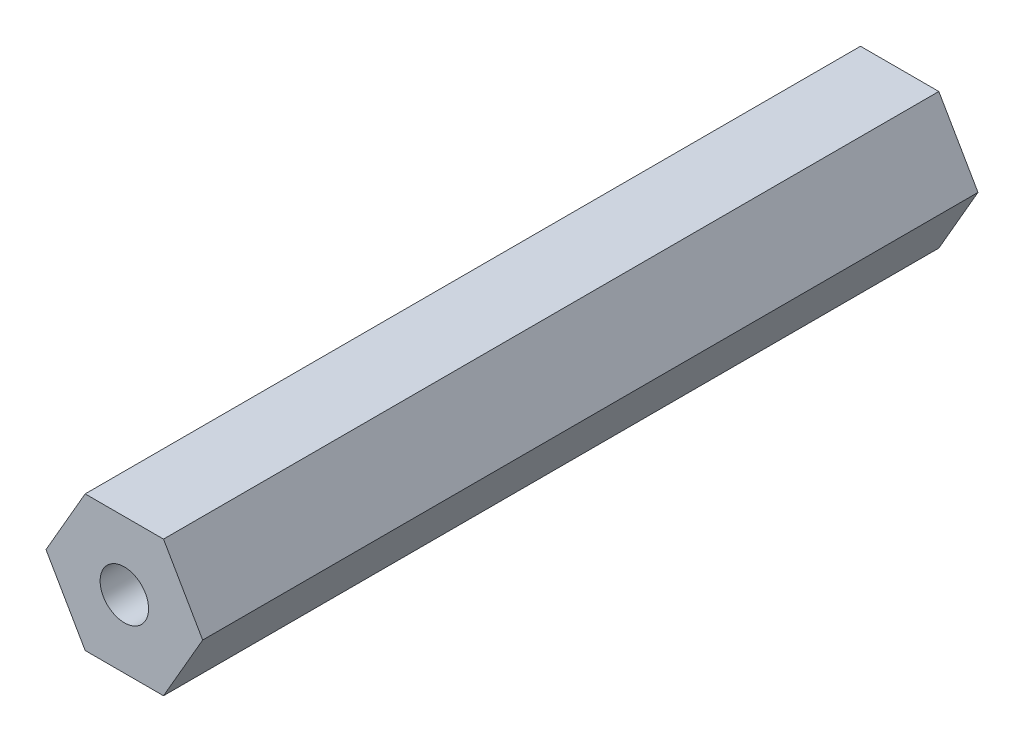
ISO-10303-21;
HEADER;
FILE_DESCRIPTION(('STEP AP214'),'2;1');
FILE_NAME('part.step','',(''),(''),'','','');
FILE_SCHEMA(('AUTOMOTIVE_DESIGN { 1 0 10303 214 1 1 1 1 }'));
ENDSEC;
DATA;
#1=APPLICATION_CONTEXT('core data for automotive mechanical design processes');
#2=APPLICATION_PROTOCOL_DEFINITION('international standard','automotive_design',2000,#1);
#3=PRODUCT_CONTEXT('',#1,'mechanical');
#4=PRODUCT('Part','Part','',(#3));
#5=PRODUCT_RELATED_PRODUCT_CATEGORY('part','',(#4));
#6=PRODUCT_DEFINITION_FORMATION('','',#4);
#7=PRODUCT_DEFINITION_CONTEXT('part definition',#1,'design');
#8=PRODUCT_DEFINITION('design','',#6,#7);
#9=PRODUCT_DEFINITION_SHAPE('','',#8);
#10=(LENGTH_UNIT() NAMED_UNIT(*) SI_UNIT(.MILLI.,.METRE.));
#11=(NAMED_UNIT(*) PLANE_ANGLE_UNIT() SI_UNIT($,.RADIAN.));
#12=(NAMED_UNIT(*) SI_UNIT($,.STERADIAN.) SOLID_ANGLE_UNIT());
#13=UNCERTAINTY_MEASURE_WITH_UNIT(LENGTH_MEASURE(1.E-05),#10,'distance_accuracy_value','');
#14=(GEOMETRIC_REPRESENTATION_CONTEXT(3) GLOBAL_UNCERTAINTY_ASSIGNED_CONTEXT((#13)) GLOBAL_UNIT_ASSIGNED_CONTEXT((#10,
#11,#12)) REPRESENTATION_CONTEXT('',''));
#15=CARTESIAN_POINT('',(0.,0.,0.));
#16=DIRECTION('',(0.,0.,1.));
#17=DIRECTION('',(1.,0.,0.));
#18=AXIS2_PLACEMENT_3D('',#15,#16,#17);
#19=CARTESIAN_POINT('',(2.02072594216369,3.5,40.));
#20=DIRECTION('',(0.,-1.,0.));
#21=DIRECTION('',(1.,0.,0.));
#22=AXIS2_PLACEMENT_3D('',#19,#20,#21);
#23=PLANE('',#22);
#24=DIRECTION('',(-1.,0.,0.));
#25=VECTOR('',#24,1.);
#26=CARTESIAN_POINT('',(2.02072594216369,3.5,0.));
#27=LINE('',#26,#25);
#28=CARTESIAN_POINT('',(2.02072594216369,3.5,0.));
#29=VERTEX_POINT('',#28);
#30=CARTESIAN_POINT('',(-2.02072594216369,3.5,0.));
#31=VERTEX_POINT('',#30);
#32=EDGE_CURVE('E121',#29,#31,#27,.T.);
#33=ORIENTED_EDGE('',*,*,#32,.T.);
#34=DIRECTION('',(0.,0.,-1.));
#35=VECTOR('',#34,1.);
#36=CARTESIAN_POINT('',(-2.02072594216369,3.5,40.));
#37=LINE('',#36,#35);
#38=CARTESIAN_POINT('',(-2.02072594216369,3.5,40.));
#39=VERTEX_POINT('',#38);
#40=EDGE_CURVE('E11',#39,#31,#37,.T.);
#41=ORIENTED_EDGE('',*,*,#40,.F.);
#42=DIRECTION('',(-1.,0.,0.));
#43=VECTOR('',#42,1.);
#44=CARTESIAN_POINT('',(2.02072594216369,3.5,40.));
#45=LINE('',#44,#43);
#46=CARTESIAN_POINT('',(2.02072594216369,3.5,40.));
#47=VERTEX_POINT('',#46);
#48=EDGE_CURVE('E132',#47,#39,#45,.T.);
#49=ORIENTED_EDGE('',*,*,#48,.F.);
#50=DIRECTION('',(0.,0.,-1.));
#51=VECTOR('',#50,1.);
#52=CARTESIAN_POINT('',(2.02072594216369,3.5,40.));
#53=LINE('',#52,#51);
#54=EDGE_CURVE('E117',#47,#29,#53,.T.);
#55=ORIENTED_EDGE('',*,*,#54,.T.);
#56=EDGE_LOOP('',(#33,#41,#49,#55));
#57=FACE_BOUND('',#56,.T.);
#58=ADVANCED_FACE('F37',(#57),#23,.F.);
#59=CARTESIAN_POINT('',(-2.02072594216369,3.5,40.));
#60=DIRECTION('',(0.866025403784439,-0.5,0.));
#61=DIRECTION('',(0.5,0.866025403784439,0.));
#62=AXIS2_PLACEMENT_3D('',#59,#60,#61);
#63=PLANE('',#62);
#64=DIRECTION('',(-0.5,-0.866025403784439,0.));
#65=VECTOR('',#64,1.);
#66=CARTESIAN_POINT('',(-2.02072594216369,3.5,0.));
#67=LINE('',#66,#65);
#68=CARTESIAN_POINT('',(-4.04145188432738,0.,0.));
#69=VERTEX_POINT('',#68);
#70=EDGE_CURVE('E124',#31,#69,#67,.T.);
#71=ORIENTED_EDGE('',*,*,#70,.T.);
#72=DIRECTION('',(0.,0.,-1.));
#73=VECTOR('',#72,1.);
#74=CARTESIAN_POINT('',(-4.04145188432738,0.,40.));
#75=LINE('',#74,#73);
#76=CARTESIAN_POINT('',(-4.04145188432738,0.,40.));
#77=VERTEX_POINT('',#76);
#78=EDGE_CURVE('E45',#77,#69,#75,.T.);
#79=ORIENTED_EDGE('',*,*,#78,.F.);
#80=DIRECTION('',(-0.5,-0.866025403784439,0.));
#81=VECTOR('',#80,1.);
#82=CARTESIAN_POINT('',(-2.02072594216369,3.5,40.));
#83=LINE('',#82,#81);
#84=EDGE_CURVE('E90',#39,#77,#83,.T.);
#85=ORIENTED_EDGE('',*,*,#84,.F.);
#86=ORIENTED_EDGE('',*,*,#40,.T.);
#87=EDGE_LOOP('',(#71,#79,#85,#86));
#88=FACE_BOUND('',#87,.T.);
#89=ADVANCED_FACE('F157',(#88),#63,.F.);
#90=CARTESIAN_POINT('',(-4.04145188432738,0.,40.));
#91=DIRECTION('',(0.866025403784438,0.5,0.));
#92=DIRECTION('',(-0.5,0.866025403784439,0.));
#93=AXIS2_PLACEMENT_3D('',#90,#91,#92);
#94=PLANE('',#93);
#95=DIRECTION('',(0.5,-0.866025403784439,0.));
#96=VECTOR('',#95,1.);
#97=CARTESIAN_POINT('',(-4.04145188432738,0.,0.));
#98=LINE('',#97,#96);
#99=CARTESIAN_POINT('',(-2.02072594216369,-3.5,0.));
#100=VERTEX_POINT('',#99);
#101=EDGE_CURVE('E127',#69,#100,#98,.T.);
#102=ORIENTED_EDGE('',*,*,#101,.T.);
#103=DIRECTION('',(0.,0.,-1.));
#104=VECTOR('',#103,1.);
#105=CARTESIAN_POINT('',(-2.02072594216369,-3.5,40.));
#106=LINE('',#105,#104);
#107=CARTESIAN_POINT('',(-2.02072594216369,-3.5,40.));
#108=VERTEX_POINT('',#107);
#109=EDGE_CURVE('E112',#108,#100,#106,.T.);
#110=ORIENTED_EDGE('',*,*,#109,.F.);
#111=DIRECTION('',(0.5,-0.866025403784439,0.));
#112=VECTOR('',#111,1.);
#113=CARTESIAN_POINT('',(-4.04145188432738,0.,40.));
#114=LINE('',#113,#112);
#115=EDGE_CURVE('E103',#77,#108,#114,.T.);
#116=ORIENTED_EDGE('',*,*,#115,.F.);
#117=ORIENTED_EDGE('',*,*,#78,.T.);
#118=EDGE_LOOP('',(#102,#110,#116,#117));
#119=FACE_BOUND('',#118,.T.);
#120=ADVANCED_FACE('F138',(#119),#94,.F.);
#121=CARTESIAN_POINT('',(-2.02072594216369,-3.5,40.));
#122=DIRECTION('',(0.,1.,0.));
#123=DIRECTION('',(-1.,0.,0.));
#124=AXIS2_PLACEMENT_3D('',#121,#122,#123);
#125=PLANE('',#124);
#126=DIRECTION('',(1.,0.,0.));
#127=VECTOR('',#126,1.);
#128=CARTESIAN_POINT('',(-2.02072594216369,-3.5,0.));
#129=LINE('',#128,#127);
#130=CARTESIAN_POINT('',(2.02072594216369,-3.5,0.));
#131=VERTEX_POINT('',#130);
#132=EDGE_CURVE('E111',#100,#131,#129,.T.);
#133=ORIENTED_EDGE('',*,*,#132,.T.);
#134=DIRECTION('',(0.,0.,-1.));
#135=VECTOR('',#134,1.);
#136=CARTESIAN_POINT('',(2.02072594216369,-3.5,40.));
#137=LINE('',#136,#135);
#138=CARTESIAN_POINT('',(2.02072594216369,-3.5,40.));
#139=VERTEX_POINT('',#138);
#140=EDGE_CURVE('E108',#139,#131,#137,.T.);
#141=ORIENTED_EDGE('',*,*,#140,.F.);
#142=DIRECTION('',(1.,0.,0.));
#143=VECTOR('',#142,1.);
#144=CARTESIAN_POINT('',(-2.02072594216369,-3.5,40.));
#145=LINE('',#144,#143);
#146=EDGE_CURVE('E97',#108,#139,#145,.T.);
#147=ORIENTED_EDGE('',*,*,#146,.F.);
#148=ORIENTED_EDGE('',*,*,#109,.T.);
#149=EDGE_LOOP('',(#133,#141,#147,#148));
#150=FACE_BOUND('',#149,.T.);
#151=ADVANCED_FACE('F109',(#150),#125,.F.);
#152=CARTESIAN_POINT('',(2.02072594216369,-3.5,40.));
#153=DIRECTION('',(-0.866025403784439,0.5,0.));
#154=DIRECTION('',(-0.5,-0.866025403784439,0.));
#155=AXIS2_PLACEMENT_3D('',#152,#153,#154);
#156=PLANE('',#155);
#157=DIRECTION('',(0.5,0.866025403784439,0.));
#158=VECTOR('',#157,1.);
#159=CARTESIAN_POINT('',(2.02072594216369,-3.5,0.));
#160=LINE('',#159,#158);
#161=CARTESIAN_POINT('',(4.04145188432738,0.,0.));
#162=VERTEX_POINT('',#161);
#163=EDGE_CURVE('E76',#131,#162,#160,.T.);
#164=ORIENTED_EDGE('',*,*,#163,.T.);
#165=DIRECTION('',(0.,0.,-1.));
#166=VECTOR('',#165,1.);
#167=CARTESIAN_POINT('',(4.04145188432738,0.,40.));
#168=LINE('',#167,#166);
#169=CARTESIAN_POINT('',(4.04145188432738,0.,40.));
#170=VERTEX_POINT('',#169);
#171=EDGE_CURVE('E113',#170,#162,#168,.T.);
#172=ORIENTED_EDGE('',*,*,#171,.F.);
#173=DIRECTION('',(0.5,0.866025403784439,0.));
#174=VECTOR('',#173,1.);
#175=CARTESIAN_POINT('',(2.02072594216369,-3.5,40.));
#176=LINE('',#175,#174);
#177=EDGE_CURVE('E101',#139,#170,#176,.T.);
#178=ORIENTED_EDGE('',*,*,#177,.F.);
#179=ORIENTED_EDGE('',*,*,#140,.T.);
#180=EDGE_LOOP('',(#164,#172,#178,#179));
#181=FACE_BOUND('',#180,.T.);
#182=ADVANCED_FACE('F115',(#181),#156,.F.);
#183=CARTESIAN_POINT('',(4.04145188432738,0.,40.));
#184=DIRECTION('',(-0.866025403784439,-0.5,0.));
#185=DIRECTION('',(0.5,-0.866025403784439,0.));
#186=AXIS2_PLACEMENT_3D('',#183,#184,#185);
#187=PLANE('',#186);
#188=DIRECTION('',(-0.5,0.866025403784438,0.));
#189=VECTOR('',#188,1.);
#190=CARTESIAN_POINT('',(4.04145188432738,0.,0.));
#191=LINE('',#190,#189);
#192=EDGE_CURVE('E82',#162,#29,#191,.T.);
#193=ORIENTED_EDGE('',*,*,#192,.T.);
#194=ORIENTED_EDGE('',*,*,#54,.F.);
#195=DIRECTION('',(-0.5,0.866025403784438,0.));
#196=VECTOR('',#195,1.);
#197=CARTESIAN_POINT('',(4.04145188432738,0.,40.));
#198=LINE('',#197,#196);
#199=EDGE_CURVE('E53',#170,#47,#198,.T.);
#200=ORIENTED_EDGE('',*,*,#199,.F.);
#201=ORIENTED_EDGE('',*,*,#171,.T.);
#202=EDGE_LOOP('',(#193,#194,#200,#201));
#203=FACE_BOUND('',#202,.T.);
#204=ADVANCED_FACE('F145',(#203),#187,.F.);
#205=CARTESIAN_POINT('',(0.,0.,40.));
#206=DIRECTION('',(0.,0.,1.));
#207=DIRECTION('',(1.,0.,0.));
#208=AXIS2_PLACEMENT_3D('',#205,#206,#207);
#209=PLANE('',#208);
#210=CARTESIAN_POINT('',(0.,0.,40.));
#211=DIRECTION('',(0.,0.,1.));
#212=DIRECTION('',(1.,0.,0.));
#213=AXIS2_PLACEMENT_3D('',#210,#211,#212);
#214=CIRCLE('',#213,1.24999999999999);
#215=CARTESIAN_POINT('',(1.24999999999999,0.,40.));
#216=VERTEX_POINT('',#215);
#217=EDGE_CURVE('E212',#216,#216,#214,.T.);
#218=ORIENTED_EDGE('',*,*,#217,.F.);
#219=EDGE_LOOP('',(#218));
#220=FACE_BOUND('',#219,.T.);
#221=ORIENTED_EDGE('',*,*,#48,.T.);
#222=ORIENTED_EDGE('',*,*,#84,.T.);
#223=ORIENTED_EDGE('',*,*,#115,.T.);
#224=ORIENTED_EDGE('',*,*,#146,.T.);
#225=ORIENTED_EDGE('',*,*,#177,.T.);
#226=ORIENTED_EDGE('',*,*,#199,.T.);
#227=EDGE_LOOP('',(#221,#222,#223,#224,#225,#226));
#228=FACE_BOUND('',#227,.T.);
#229=ADVANCED_FACE('F99',(#220,#228),#209,.T.);
#230=CARTESIAN_POINT('',(0.,0.,0.));
#231=DIRECTION('',(0.,0.,1.));
#232=DIRECTION('',(1.,0.,0.));
#233=AXIS2_PLACEMENT_3D('',#230,#231,#232);
#234=PLANE('',#233);
#235=CARTESIAN_POINT('',(0.,0.,0.));
#236=DIRECTION('',(0.,0.,1.));
#237=DIRECTION('',(1.,0.,0.));
#238=AXIS2_PLACEMENT_3D('',#235,#236,#237);
#239=CIRCLE('',#238,1.24999999999999);
#240=CARTESIAN_POINT('',(1.24999999999999,0.,0.));
#241=VERTEX_POINT('',#240);
#242=EDGE_CURVE('E125',#241,#241,#239,.T.);
#243=ORIENTED_EDGE('',*,*,#242,.T.);
#244=EDGE_LOOP('',(#243));
#245=FACE_BOUND('',#244,.T.);
#246=ORIENTED_EDGE('',*,*,#32,.F.);
#247=ORIENTED_EDGE('',*,*,#192,.F.);
#248=ORIENTED_EDGE('',*,*,#163,.F.);
#249=ORIENTED_EDGE('',*,*,#132,.F.);
#250=ORIENTED_EDGE('',*,*,#101,.F.);
#251=ORIENTED_EDGE('',*,*,#70,.F.);
#252=EDGE_LOOP('',(#246,#247,#248,#249,#250,#251));
#253=FACE_BOUND('',#252,.T.);
#254=ADVANCED_FACE('F141',(#245,#253),#234,.F.);
#255=CARTESIAN_POINT('',(0.,0.,40.));
#256=DIRECTION('',(0.,0.,1.));
#257=DIRECTION('',(1.,0.,0.));
#258=AXIS2_PLACEMENT_3D('',#255,#256,#257);
#259=CYLINDRICAL_SURFACE('',#258,1.24999999999999);
#260=ORIENTED_EDGE('',*,*,#242,.F.);
#261=EDGE_LOOP('',(#260));
#262=FACE_BOUND('',#261,.T.);
#263=ORIENTED_EDGE('',*,*,#217,.T.);
#264=EDGE_LOOP('',(#263));
#265=FACE_BOUND('',#264,.T.);
#266=ADVANCED_FACE('F194',(#262,#265),#259,.F.);
#267=CLOSED_SHELL('',(#58,#89,#120,#151,#182,#204,#229,#254,#266));
#268=MANIFOLD_SOLID_BREP('B2',#267);
#269=ADVANCED_BREP_SHAPE_REPRESENTATION('',(#18,#268),#14);
#270=SHAPE_DEFINITION_REPRESENTATION(#9,#269);
ENDSEC;
END-ISO-10303-21;
